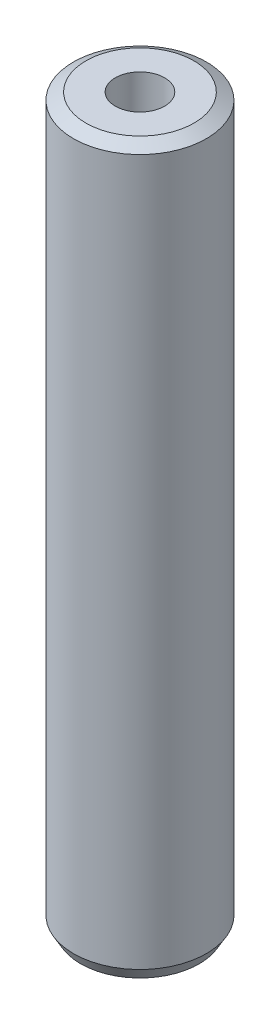
ISO-10303-21;
HEADER;
FILE_DESCRIPTION(('STEP AP214'),'2;1');
FILE_NAME('part.step','',(''),(''),'','','');
FILE_SCHEMA(('AUTOMOTIVE_DESIGN { 1 0 10303 214 1 1 1 1 }'));
ENDSEC;
DATA;
#1=APPLICATION_CONTEXT('core data for automotive mechanical design processes');
#2=APPLICATION_PROTOCOL_DEFINITION('international standard','automotive_design',2000,#1);
#3=PRODUCT_CONTEXT('',#1,'mechanical');
#4=PRODUCT('Part','Part','',(#3));
#5=PRODUCT_RELATED_PRODUCT_CATEGORY('part','',(#4));
#6=PRODUCT_DEFINITION_FORMATION('','',#4);
#7=PRODUCT_DEFINITION_CONTEXT('part definition',#1,'design');
#8=PRODUCT_DEFINITION('design','',#6,#7);
#9=PRODUCT_DEFINITION_SHAPE('','',#8);
#10=(LENGTH_UNIT() NAMED_UNIT(*) SI_UNIT(.MILLI.,.METRE.));
#11=(NAMED_UNIT(*) PLANE_ANGLE_UNIT() SI_UNIT($,.RADIAN.));
#12=(NAMED_UNIT(*) SI_UNIT($,.STERADIAN.) SOLID_ANGLE_UNIT());
#13=UNCERTAINTY_MEASURE_WITH_UNIT(LENGTH_MEASURE(1.E-05),#10,'distance_accuracy_value','');
#14=(GEOMETRIC_REPRESENTATION_CONTEXT(3) GLOBAL_UNCERTAINTY_ASSIGNED_CONTEXT((#13)) GLOBAL_UNIT_ASSIGNED_CONTEXT((#10,
#11,#12)) REPRESENTATION_CONTEXT('',''));
#15=CARTESIAN_POINT('',(0.,0.,0.));
#16=DIRECTION('',(0.,0.,1.));
#17=DIRECTION('',(1.,0.,0.));
#18=AXIS2_PLACEMENT_3D('',#15,#16,#17);
#19=CARTESIAN_POINT('',(0.,600.,0.));
#20=DIRECTION('',(0.,-1.,0.));
#21=DIRECTION('',(0.,0.,-1.));
#22=AXIS2_PLACEMENT_3D('',#19,#20,#21);
#23=CYLINDRICAL_SURFACE('',#22,55.);
#24=CARTESIAN_POINT('',(0.,594.038183549126,0.));
#25=DIRECTION('',(0.,1.,0.));
#26=DIRECTION('',(0.,0.,1.));
#27=AXIS2_PLACEMENT_3D('',#24,#25,#26);
#28=CIRCLE('',#27,55.);
#29=CARTESIAN_POINT('',(0.,594.038183549126,55.));
#30=VERTEX_POINT('',#29);
#31=EDGE_CURVE('E50',#30,#30,#28,.F.);
#32=ORIENTED_EDGE('',*,*,#31,.T.);
#33=EDGE_LOOP('',(#32));
#34=FACE_BOUND('',#33,.T.);
#35=CARTESIAN_POINT('',(0.,10.326168998313,0.));
#36=DIRECTION('',(0.,1.,0.));
#37=DIRECTION('',(0.,0.,1.));
#38=AXIS2_PLACEMENT_3D('',#35,#36,#37);
#39=CIRCLE('',#38,55.);
#40=CARTESIAN_POINT('',(0.,10.326168998313,55.));
#41=VERTEX_POINT('',#40);
#42=EDGE_CURVE('E51',#41,#41,#39,.T.);
#43=ORIENTED_EDGE('',*,*,#42,.T.);
#44=EDGE_LOOP('',(#43));
#45=FACE_BOUND('',#44,.T.);
#46=ADVANCED_FACE('F39',(#34,#45),#23,.T.);
#47=CARTESIAN_POINT('',(0.,600.,0.));
#48=DIRECTION('',(0.,1.,0.));
#49=DIRECTION('',(0.,0.,1.));
#50=AXIS2_PLACEMENT_3D('',#47,#48,#49);
#51=PLANE('',#50);
#52=CARTESIAN_POINT('',(0.,600.,0.));
#53=DIRECTION('',(0.,1.,0.));
#54=DIRECTION('',(0.,0.,1.));
#55=AXIS2_PLACEMENT_3D('',#52,#53,#54);
#56=CIRCLE('',#55,44.6738310016868);
#57=CARTESIAN_POINT('',(0.,600.,44.6738310016868));
#58=VERTEX_POINT('',#57);
#59=EDGE_CURVE('E54',#58,#58,#56,.T.);
#60=ORIENTED_EDGE('',*,*,#59,.T.);
#61=EDGE_LOOP('',(#60));
#62=FACE_BOUND('',#61,.T.);
#63=CARTESIAN_POINT('',(0.,600.,0.));
#64=DIRECTION('',(0.,1.,0.));
#65=DIRECTION('',(0.,0.,1.));
#66=AXIS2_PLACEMENT_3D('',#63,#64,#65);
#67=CIRCLE('',#66,20.3794315416266);
#68=CARTESIAN_POINT('',(0.,600.,20.3794315416266));
#69=VERTEX_POINT('',#68);
#70=EDGE_CURVE('E58',#69,#69,#67,.T.);
#71=ORIENTED_EDGE('',*,*,#70,.F.);
#72=EDGE_LOOP('',(#71));
#73=FACE_BOUND('',#72,.T.);
#74=ADVANCED_FACE('F69',(#62,#73),#51,.T.);
#75=CARTESIAN_POINT('',(0.,0.,0.));
#76=DIRECTION('',(0.,1.,0.));
#77=DIRECTION('',(0.,0.,1.));
#78=AXIS2_PLACEMENT_3D('',#75,#76,#77);
#79=PLANE('',#78);
#80=CARTESIAN_POINT('',(0.,0.,0.));
#81=DIRECTION('',(0.,1.,0.));
#82=DIRECTION('',(0.,0.,1.));
#83=AXIS2_PLACEMENT_3D('',#80,#81,#82);
#84=CIRCLE('',#83,49.0381835491264);
#85=CARTESIAN_POINT('',(0.,0.,49.0381835491264));
#86=VERTEX_POINT('',#85);
#87=EDGE_CURVE('E10',#86,#86,#84,.F.);
#88=ORIENTED_EDGE('',*,*,#87,.T.);
#89=EDGE_LOOP('',(#88));
#90=FACE_BOUND('',#89,.T.);
#91=CARTESIAN_POINT('',(0.,0.,0.));
#92=DIRECTION('',(0.,1.,0.));
#93=DIRECTION('',(0.,0.,1.));
#94=AXIS2_PLACEMENT_3D('',#91,#92,#93);
#95=CIRCLE('',#94,20.3794315416266);
#96=CARTESIAN_POINT('',(0.,0.,20.3794315416266));
#97=VERTEX_POINT('',#96);
#98=EDGE_CURVE('E63',#97,#97,#95,.T.);
#99=ORIENTED_EDGE('',*,*,#98,.T.);
#100=EDGE_LOOP('',(#99));
#101=FACE_BOUND('',#100,.T.);
#102=ADVANCED_FACE('F75',(#90,#101),#79,.F.);
#103=CARTESIAN_POINT('',(0.,600.,0.));
#104=DIRECTION('',(0.,-1.,0.));
#105=DIRECTION('',(0.,0.,-1.));
#106=AXIS2_PLACEMENT_3D('',#103,#104,#105);
#107=CYLINDRICAL_SURFACE('',#106,20.3794315416266);
#108=ORIENTED_EDGE('',*,*,#70,.T.);
#109=EDGE_LOOP('',(#108));
#110=FACE_BOUND('',#109,.T.);
#111=ORIENTED_EDGE('',*,*,#98,.F.);
#112=EDGE_LOOP('',(#111));
#113=FACE_BOUND('',#112,.T.);
#114=ADVANCED_FACE('F70',(#110,#113),#107,.F.);
#115=CARTESIAN_POINT('',(0.,600.,0.));
#116=DIRECTION('',(0.,-1.,0.));
#117=DIRECTION('',(0.,0.,-1.));
#118=AXIS2_PLACEMENT_3D('',#115,#116,#117);
#119=CONICAL_SURFACE('',#118,44.6738310016868,1.0471975511966);
#120=ORIENTED_EDGE('',*,*,#31,.F.);
#121=EDGE_LOOP('',(#120));
#122=FACE_BOUND('',#121,.T.);
#123=ORIENTED_EDGE('',*,*,#59,.F.);
#124=EDGE_LOOP('',(#123));
#125=FACE_BOUND('',#124,.T.);
#126=ADVANCED_FACE('F81',(#122,#125),#119,.T.);
#127=CARTESIAN_POINT('',(0.,10.326168998313,0.));
#128=DIRECTION('',(0.,1.,0.));
#129=DIRECTION('',(0.,0.,1.));
#130=AXIS2_PLACEMENT_3D('',#127,#128,#129);
#131=CONICAL_SURFACE('',#130,55.,0.5235987755983);
#132=ORIENTED_EDGE('',*,*,#87,.F.);
#133=EDGE_LOOP('',(#132));
#134=FACE_BOUND('',#133,.T.);
#135=ORIENTED_EDGE('',*,*,#42,.F.);
#136=EDGE_LOOP('',(#135));
#137=FACE_BOUND('',#136,.T.);
#138=ADVANCED_FACE('F45',(#134,#137),#131,.T.);
#139=CLOSED_SHELL('',(#46,#74,#102,#114,#126,#138));
#140=MANIFOLD_SOLID_BREP('B2',#139);
#141=ADVANCED_BREP_SHAPE_REPRESENTATION('',(#18,#140),#14);
#142=SHAPE_DEFINITION_REPRESENTATION(#9,#141);
ENDSEC;
END-ISO-10303-21;
